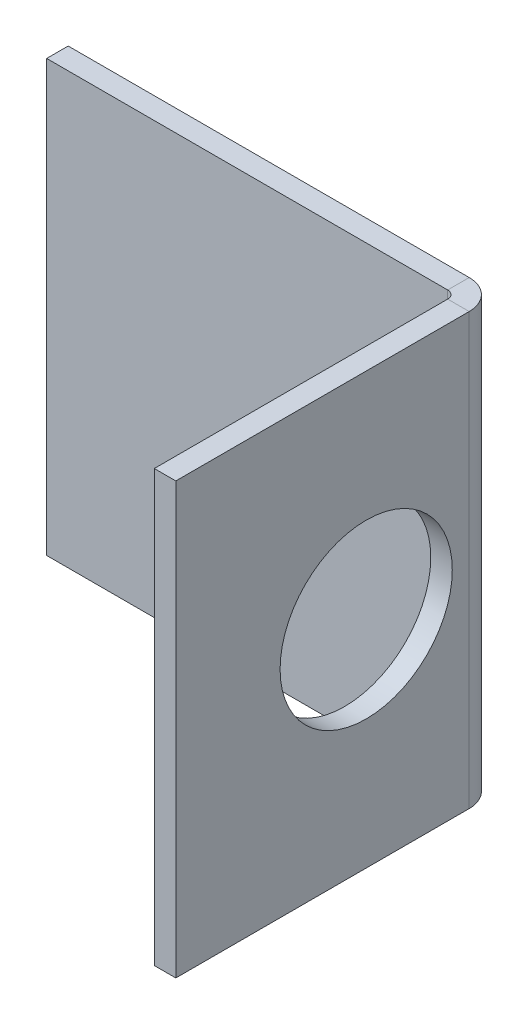
ISO-10303-21;
HEADER;
FILE_DESCRIPTION(('STEP AP214'),'2;1');
FILE_NAME('part.step','',(''),(''),'','','');
FILE_SCHEMA(('AUTOMOTIVE_DESIGN { 1 0 10303 214 1 1 1 1 }'));
ENDSEC;
DATA;
#1=APPLICATION_CONTEXT('core data for automotive mechanical design processes');
#2=APPLICATION_PROTOCOL_DEFINITION('international standard','automotive_design',2000,#1);
#3=PRODUCT_CONTEXT('',#1,'mechanical');
#4=PRODUCT('Part','Part','',(#3));
#5=PRODUCT_RELATED_PRODUCT_CATEGORY('part','',(#4));
#6=PRODUCT_DEFINITION_FORMATION('','',#4);
#7=PRODUCT_DEFINITION_CONTEXT('part definition',#1,'design');
#8=PRODUCT_DEFINITION('design','',#6,#7);
#9=PRODUCT_DEFINITION_SHAPE('','',#8);
#10=(LENGTH_UNIT() NAMED_UNIT(*) SI_UNIT(.MILLI.,.METRE.));
#11=(NAMED_UNIT(*) PLANE_ANGLE_UNIT() SI_UNIT($,.RADIAN.));
#12=(NAMED_UNIT(*) SI_UNIT($,.STERADIAN.) SOLID_ANGLE_UNIT());
#13=UNCERTAINTY_MEASURE_WITH_UNIT(LENGTH_MEASURE(1.E-05),#10,'distance_accuracy_value','');
#14=(GEOMETRIC_REPRESENTATION_CONTEXT(3) GLOBAL_UNCERTAINTY_ASSIGNED_CONTEXT((#13)) GLOBAL_UNIT_ASSIGNED_CONTEXT((#10,
#11,#12)) REPRESENTATION_CONTEXT('',''));
#15=CARTESIAN_POINT('',(0.,0.,0.));
#16=DIRECTION('',(0.,0.,1.));
#17=DIRECTION('',(1.,0.,0.));
#18=AXIS2_PLACEMENT_3D('',#15,#16,#17);
#19=CARTESIAN_POINT('',(-20.,20.,2.));
#20=DIRECTION('',(0.,-1.,0.));
#21=DIRECTION('',(0.,0.,-1.));
#22=AXIS2_PLACEMENT_3D('',#19,#20,#21);
#23=PLANE('',#22);
#24=DIRECTION('',(0.,0.,-1.));
#25=VECTOR('',#24,1.);
#26=CARTESIAN_POINT('',(17.2634,20.,2.));
#27=LINE('',#26,#25);
#28=CARTESIAN_POINT('',(17.2634,20.,2.));
#29=VERTEX_POINT('',#28);
#30=CARTESIAN_POINT('',(17.2634,20.,0.));
#31=VERTEX_POINT('',#30);
#32=EDGE_CURVE('E120',#29,#31,#27,.T.);
#33=ORIENTED_EDGE('',*,*,#32,.T.);
#34=DIRECTION('',(-1.,0.,0.));
#35=VECTOR('',#34,1.);
#36=CARTESIAN_POINT('',(-20.,20.,0.));
#37=LINE('',#36,#35);
#38=CARTESIAN_POINT('',(-20.,20.,0.));
#39=VERTEX_POINT('',#38);
#40=EDGE_CURVE('E102',#31,#39,#37,.T.);
#41=ORIENTED_EDGE('',*,*,#40,.T.);
#42=DIRECTION('',(0.,0.,-1.));
#43=VECTOR('',#42,1.);
#44=CARTESIAN_POINT('',(-20.,20.,2.));
#45=LINE('',#44,#43);
#46=CARTESIAN_POINT('',(-20.,20.,2.));
#47=VERTEX_POINT('',#46);
#48=EDGE_CURVE('E13',#47,#39,#45,.T.);
#49=ORIENTED_EDGE('',*,*,#48,.F.);
#50=DIRECTION('',(-1.,0.,0.));
#51=VECTOR('',#50,1.);
#52=CARTESIAN_POINT('',(-20.,20.,2.));
#53=LINE('',#52,#51);
#54=EDGE_CURVE('E112',#29,#47,#53,.T.);
#55=ORIENTED_EDGE('',*,*,#54,.F.);
#56=EDGE_LOOP('',(#33,#41,#49,#55));
#57=FACE_BOUND('',#56,.T.);
#58=ADVANCED_FACE('F58',(#57),#23,.F.);
#59=CARTESIAN_POINT('',(-20.,-20.,2.));
#60=DIRECTION('',(0.,1.,0.));
#61=DIRECTION('',(0.,0.,1.));
#62=AXIS2_PLACEMENT_3D('',#59,#60,#61);
#63=PLANE('',#62);
#64=DIRECTION('',(0.,0.,-1.));
#65=VECTOR('',#64,1.);
#66=CARTESIAN_POINT('',(17.2634,-20.,2.));
#67=LINE('',#66,#65);
#68=CARTESIAN_POINT('',(17.2634,-20.,2.));
#69=VERTEX_POINT('',#68);
#70=CARTESIAN_POINT('',(17.2634,-20.,0.));
#71=VERTEX_POINT('',#70);
#72=EDGE_CURVE('E117',#69,#71,#67,.T.);
#73=ORIENTED_EDGE('',*,*,#72,.F.);
#74=DIRECTION('',(1.,0.,0.));
#75=VECTOR('',#74,1.);
#76=CARTESIAN_POINT('',(-20.,-20.,2.));
#77=LINE('',#76,#75);
#78=CARTESIAN_POINT('',(-20.,-20.,2.));
#79=VERTEX_POINT('',#78);
#80=EDGE_CURVE('E108',#79,#69,#77,.T.);
#81=ORIENTED_EDGE('',*,*,#80,.F.);
#82=DIRECTION('',(0.,0.,-1.));
#83=VECTOR('',#82,1.);
#84=CARTESIAN_POINT('',(-20.,-20.,2.));
#85=LINE('',#84,#83);
#86=CARTESIAN_POINT('',(-20.,-20.,0.));
#87=VERTEX_POINT('',#86);
#88=EDGE_CURVE('E65',#79,#87,#85,.T.);
#89=ORIENTED_EDGE('',*,*,#88,.T.);
#90=DIRECTION('',(1.,0.,0.));
#91=VECTOR('',#90,1.);
#92=CARTESIAN_POINT('',(-20.,-20.,0.));
#93=LINE('',#92,#91);
#94=EDGE_CURVE('E101',#87,#71,#93,.T.);
#95=ORIENTED_EDGE('',*,*,#94,.T.);
#96=EDGE_LOOP('',(#73,#81,#89,#95));
#97=FACE_BOUND('',#96,.T.);
#98=ADVANCED_FACE('F107',(#97),#63,.F.);
#99=CARTESIAN_POINT('',(0.,0.,2.));
#100=DIRECTION('',(0.,0.,-1.));
#101=DIRECTION('',(-1.,0.,0.));
#102=AXIS2_PLACEMENT_3D('',#99,#100,#101);
#103=PLANE('',#102);
#104=DIRECTION('',(0.,1.,0.));
#105=VECTOR('',#104,1.);
#106=CARTESIAN_POINT('',(17.2634,20.,2.));
#107=LINE('',#106,#105);
#108=EDGE_CURVE('E127',#29,#69,#107,.F.);
#109=ORIENTED_EDGE('',*,*,#108,.F.);
#110=ORIENTED_EDGE('',*,*,#54,.T.);
#111=DIRECTION('',(0.,-1.,0.));
#112=VECTOR('',#111,1.);
#113=CARTESIAN_POINT('',(-20.,-20.,2.));
#114=LINE('',#113,#112);
#115=EDGE_CURVE('E81',#47,#79,#114,.T.);
#116=ORIENTED_EDGE('',*,*,#115,.T.);
#117=ORIENTED_EDGE('',*,*,#80,.T.);
#118=EDGE_LOOP('',(#109,#110,#116,#117));
#119=FACE_BOUND('',#118,.T.);
#120=ADVANCED_FACE('F236',(#119),#103,.F.);
#121=CARTESIAN_POINT('',(0.,0.,0.));
#122=DIRECTION('',(0.,0.,-1.));
#123=DIRECTION('',(-1.,0.,0.));
#124=AXIS2_PLACEMENT_3D('',#121,#122,#123);
#125=PLANE('',#124);
#126=ORIENTED_EDGE('',*,*,#40,.F.);
#127=DIRECTION('',(0.,1.,0.));
#128=VECTOR('',#127,1.);
#129=CARTESIAN_POINT('',(17.2634,20.,0.));
#130=LINE('',#129,#128);
#131=EDGE_CURVE('E111',#31,#71,#130,.F.);
#132=ORIENTED_EDGE('',*,*,#131,.T.);
#133=ORIENTED_EDGE('',*,*,#94,.F.);
#134=DIRECTION('',(0.,-1.,0.));
#135=VECTOR('',#134,1.);
#136=CARTESIAN_POINT('',(-20.,-20.,0.));
#137=LINE('',#136,#135);
#138=EDGE_CURVE('E93',#39,#87,#137,.T.);
#139=ORIENTED_EDGE('',*,*,#138,.F.);
#140=EDGE_LOOP('',(#126,#132,#133,#139));
#141=FACE_BOUND('',#140,.T.);
#142=ADVANCED_FACE('F110',(#141),#125,.T.);
#143=CARTESIAN_POINT('',(-20.,-20.,2.));
#144=DIRECTION('',(1.,0.,0.));
#145=DIRECTION('',(0.,0.,-1.));
#146=AXIS2_PLACEMENT_3D('',#143,#144,#145);
#147=PLANE('',#146);
#148=ORIENTED_EDGE('',*,*,#138,.T.);
#149=ORIENTED_EDGE('',*,*,#88,.F.);
#150=ORIENTED_EDGE('',*,*,#115,.F.);
#151=ORIENTED_EDGE('',*,*,#48,.T.);
#152=EDGE_LOOP('',(#148,#149,#150,#151));
#153=FACE_BOUND('',#152,.T.);
#154=ADVANCED_FACE('F95',(#153),#147,.F.);
#155=CARTESIAN_POINT('',(17.2634,-20.,2.7366));
#156=DIRECTION('',(0.,-1.,0.));
#157=DIRECTION('',(0.,0.,-1.));
#158=AXIS2_PLACEMENT_3D('',#155,#156,#157);
#159=PLANE('',#158);
#160=DIRECTION('',(-1.,0.,0.));
#161=VECTOR('',#160,1.);
#162=CARTESIAN_POINT('',(20.,-20.,2.73659999999999));
#163=LINE('',#162,#161);
#164=CARTESIAN_POINT('',(18.,-20.,2.7366));
#165=VERTEX_POINT('',#164);
#166=CARTESIAN_POINT('',(20.,-20.,2.73659999999999));
#167=VERTEX_POINT('',#166);
#168=EDGE_CURVE('E139',#165,#167,#163,.F.);
#169=ORIENTED_EDGE('',*,*,#168,.F.);
#170=CARTESIAN_POINT('',(17.2634,-20.,2.7366));
#171=DIRECTION('',(0.,1.,0.));
#172=DIRECTION('',(0.,0.,1.));
#173=AXIS2_PLACEMENT_3D('',#170,#171,#172);
#174=CIRCLE('',#173,0.7366);
#175=EDGE_CURVE('E131',#69,#165,#174,.F.);
#176=ORIENTED_EDGE('',*,*,#175,.F.);
#177=ORIENTED_EDGE('',*,*,#72,.T.);
#178=CARTESIAN_POINT('',(17.2634,-20.,2.7366));
#179=DIRECTION('',(0.,1.,0.));
#180=DIRECTION('',(0.,0.,1.));
#181=AXIS2_PLACEMENT_3D('',#178,#179,#180);
#182=CIRCLE('',#181,2.7366);
#183=EDGE_CURVE('E72',#71,#167,#182,.F.);
#184=ORIENTED_EDGE('',*,*,#183,.T.);
#185=EDGE_LOOP('',(#169,#176,#177,#184));
#186=FACE_BOUND('',#185,.T.);
#187=ADVANCED_FACE('F248',(#186),#159,.T.);
#188=CARTESIAN_POINT('',(17.2634,20.,2.7366));
#189=DIRECTION('',(0.,-1.,0.));
#190=DIRECTION('',(0.,0.,-1.));
#191=AXIS2_PLACEMENT_3D('',#188,#189,#190);
#192=PLANE('',#191);
#193=CARTESIAN_POINT('',(17.2634,20.,2.7366));
#194=DIRECTION('',(0.,1.,0.));
#195=DIRECTION('',(0.,0.,1.));
#196=AXIS2_PLACEMENT_3D('',#193,#194,#195);
#197=CIRCLE('',#196,0.7366);
#198=CARTESIAN_POINT('',(18.,20.,2.7366));
#199=VERTEX_POINT('',#198);
#200=EDGE_CURVE('E124',#199,#29,#197,.T.);
#201=ORIENTED_EDGE('',*,*,#200,.F.);
#202=DIRECTION('',(-1.,0.,0.));
#203=VECTOR('',#202,1.);
#204=CARTESIAN_POINT('',(18.,20.,2.7366));
#205=LINE('',#204,#203);
#206=CARTESIAN_POINT('',(20.,20.,2.73659999999999));
#207=VERTEX_POINT('',#206);
#208=EDGE_CURVE('E146',#199,#207,#205,.F.);
#209=ORIENTED_EDGE('',*,*,#208,.T.);
#210=CARTESIAN_POINT('',(17.2634,20.,2.7366));
#211=DIRECTION('',(0.,1.,0.));
#212=DIRECTION('',(0.,0.,1.));
#213=AXIS2_PLACEMENT_3D('',#210,#211,#212);
#214=CIRCLE('',#213,2.7366);
#215=EDGE_CURVE('E134',#207,#31,#214,.T.);
#216=ORIENTED_EDGE('',*,*,#215,.T.);
#217=ORIENTED_EDGE('',*,*,#32,.F.);
#218=EDGE_LOOP('',(#201,#209,#216,#217));
#219=FACE_BOUND('',#218,.T.);
#220=ADVANCED_FACE('F229',(#219),#192,.F.);
#221=CARTESIAN_POINT('',(17.2634,20.,2.7366));
#222=DIRECTION('',(0.,1.,0.));
#223=DIRECTION('',(1.,0.,0.));
#224=AXIS2_PLACEMENT_3D('',#221,#222,#223);
#225=CYLINDRICAL_SURFACE('',#224,2.7366);
#226=ORIENTED_EDGE('',*,*,#131,.F.);
#227=ORIENTED_EDGE('',*,*,#215,.F.);
#228=DIRECTION('',(0.,1.,0.));
#229=VECTOR('',#228,1.);
#230=CARTESIAN_POINT('',(20.,-20.,2.73659999999999));
#231=LINE('',#230,#229);
#232=EDGE_CURVE('E149',#207,#167,#231,.F.);
#233=ORIENTED_EDGE('',*,*,#232,.T.);
#234=ORIENTED_EDGE('',*,*,#183,.F.);
#235=EDGE_LOOP('',(#226,#227,#233,#234));
#236=FACE_BOUND('',#235,.T.);
#237=ADVANCED_FACE('F303',(#236),#225,.T.);
#238=CARTESIAN_POINT('',(17.2634,20.,2.7366));
#239=DIRECTION('',(0.,1.,0.));
#240=DIRECTION('',(1.,0.,0.));
#241=AXIS2_PLACEMENT_3D('',#238,#239,#240);
#242=CYLINDRICAL_SURFACE('',#241,0.7366);
#243=ORIENTED_EDGE('',*,*,#108,.T.);
#244=ORIENTED_EDGE('',*,*,#175,.T.);
#245=DIRECTION('',(0.,1.,0.));
#246=VECTOR('',#245,1.);
#247=CARTESIAN_POINT('',(18.,-20.,2.7366));
#248=LINE('',#247,#246);
#249=EDGE_CURVE('E142',#165,#199,#248,.T.);
#250=ORIENTED_EDGE('',*,*,#249,.T.);
#251=ORIENTED_EDGE('',*,*,#200,.T.);
#252=EDGE_LOOP('',(#243,#244,#250,#251));
#253=FACE_BOUND('',#252,.T.);
#254=ADVANCED_FACE('F234',(#253),#242,.F.);
#255=CARTESIAN_POINT('',(20.,-20.,1.99999999999999));
#256=DIRECTION('',(0.,1.,0.));
#257=DIRECTION('',(0.,0.,1.));
#258=AXIS2_PLACEMENT_3D('',#255,#256,#257);
#259=PLANE('',#258);
#260=ORIENTED_EDGE('',*,*,#168,.T.);
#261=DIRECTION('',(0.,0.,-1.));
#262=VECTOR('',#261,1.);
#263=CARTESIAN_POINT('',(20.,-20.,0.));
#264=LINE('',#263,#262);
#265=CARTESIAN_POINT('',(20.0000000000001,-20.,30.));
#266=VERTEX_POINT('',#265);
#267=EDGE_CURVE('E160',#266,#167,#264,.T.);
#268=ORIENTED_EDGE('',*,*,#267,.F.);
#269=DIRECTION('',(-1.,0.,0.));
#270=VECTOR('',#269,1.);
#271=CARTESIAN_POINT('',(20.0000000000001,-20.,30.));
#272=LINE('',#271,#270);
#273=CARTESIAN_POINT('',(18.0000000000001,-20.,30.));
#274=VERTEX_POINT('',#273);
#275=EDGE_CURVE('E169',#266,#274,#272,.T.);
#276=ORIENTED_EDGE('',*,*,#275,.T.);
#277=DIRECTION('',(0.,0.,1.));
#278=VECTOR('',#277,1.);
#279=CARTESIAN_POINT('',(18.,-20.,2.));
#280=LINE('',#279,#278);
#281=EDGE_CURVE('E151',#274,#165,#280,.F.);
#282=ORIENTED_EDGE('',*,*,#281,.T.);
#283=EDGE_LOOP('',(#260,#268,#276,#282));
#284=FACE_BOUND('',#283,.T.);
#285=ADVANCED_FACE('F322',(#284),#259,.F.);
#286=CARTESIAN_POINT('',(20.0000000000001,20.,30.));
#287=DIRECTION('',(0.,-1.,0.));
#288=DIRECTION('',(0.,0.,-1.));
#289=AXIS2_PLACEMENT_3D('',#286,#287,#288);
#290=PLANE('',#289);
#291=ORIENTED_EDGE('',*,*,#208,.F.);
#292=DIRECTION('',(0.,0.,-1.));
#293=VECTOR('',#292,1.);
#294=CARTESIAN_POINT('',(18.0000000000001,20.,30.));
#295=LINE('',#294,#293);
#296=CARTESIAN_POINT('',(18.0000000000001,20.,30.));
#297=VERTEX_POINT('',#296);
#298=EDGE_CURVE('E154',#199,#297,#295,.F.);
#299=ORIENTED_EDGE('',*,*,#298,.T.);
#300=DIRECTION('',(-1.,0.,0.));
#301=VECTOR('',#300,1.);
#302=CARTESIAN_POINT('',(20.0000000000001,20.,30.));
#303=LINE('',#302,#301);
#304=CARTESIAN_POINT('',(20.0000000000001,20.,30.));
#305=VERTEX_POINT('',#304);
#306=EDGE_CURVE('E128',#305,#297,#303,.T.);
#307=ORIENTED_EDGE('',*,*,#306,.F.);
#308=DIRECTION('',(0.,0.,1.));
#309=VECTOR('',#308,1.);
#310=CARTESIAN_POINT('',(20.,20.,0.));
#311=LINE('',#310,#309);
#312=EDGE_CURVE('E163',#207,#305,#311,.T.);
#313=ORIENTED_EDGE('',*,*,#312,.F.);
#314=EDGE_LOOP('',(#291,#299,#307,#313));
#315=FACE_BOUND('',#314,.T.);
#316=ADVANCED_FACE('F200',(#315),#290,.F.);
#317=CARTESIAN_POINT('',(20.,0.,0.));
#318=DIRECTION('',(-1.,0.,0.));
#319=DIRECTION('',(0.,0.,1.));
#320=AXIS2_PLACEMENT_3D('',#317,#318,#319);
#321=PLANE('',#320);
#322=CARTESIAN_POINT('',(20.,0.,12.3099999999999));
#323=DIRECTION('',(-1.,0.,0.));
#324=DIRECTION('',(0.,0.,1.));
#325=AXIS2_PLACEMENT_3D('',#322,#323,#324);
#326=CIRCLE('',#325,8.);
#327=CARTESIAN_POINT('',(20.0000000000001,0.,20.3099999999999));
#328=VERTEX_POINT('',#327);
#329=EDGE_CURVE('E143',#328,#328,#326,.F.);
#330=ORIENTED_EDGE('',*,*,#329,.F.);
#331=EDGE_LOOP('',(#330));
#332=FACE_BOUND('',#331,.T.);
#333=ORIENTED_EDGE('',*,*,#232,.F.);
#334=ORIENTED_EDGE('',*,*,#312,.T.);
#335=DIRECTION('',(0.,-1.,0.));
#336=VECTOR('',#335,1.);
#337=CARTESIAN_POINT('',(20.0000000000001,0.,30.));
#338=LINE('',#337,#336);
#339=EDGE_CURVE('E166',#305,#266,#338,.T.);
#340=ORIENTED_EDGE('',*,*,#339,.T.);
#341=ORIENTED_EDGE('',*,*,#267,.T.);
#342=EDGE_LOOP('',(#333,#334,#340,#341));
#343=FACE_BOUND('',#342,.T.);
#344=ADVANCED_FACE('F187',(#332,#343),#321,.F.);
#345=CARTESIAN_POINT('',(18.,0.,0.));
#346=DIRECTION('',(-1.,0.,0.));
#347=DIRECTION('',(0.,0.,1.));
#348=AXIS2_PLACEMENT_3D('',#345,#346,#347);
#349=PLANE('',#348);
#350=CARTESIAN_POINT('',(18.,0.,12.3099999999999));
#351=DIRECTION('',(-1.,0.,0.));
#352=DIRECTION('',(0.,0.,1.));
#353=AXIS2_PLACEMENT_3D('',#350,#351,#352);
#354=CIRCLE('',#353,8.);
#355=CARTESIAN_POINT('',(18.,0.,20.3099999999999));
#356=VERTEX_POINT('',#355);
#357=EDGE_CURVE('E176',#356,#356,#354,.T.);
#358=ORIENTED_EDGE('',*,*,#357,.F.);
#359=EDGE_LOOP('',(#358));
#360=FACE_BOUND('',#359,.T.);
#361=ORIENTED_EDGE('',*,*,#298,.F.);
#362=ORIENTED_EDGE('',*,*,#249,.F.);
#363=ORIENTED_EDGE('',*,*,#281,.F.);
#364=DIRECTION('',(0.,1.,0.));
#365=VECTOR('',#364,1.);
#366=CARTESIAN_POINT('',(18.0000000000001,-20.,30.));
#367=LINE('',#366,#365);
#368=EDGE_CURVE('E157',#297,#274,#367,.F.);
#369=ORIENTED_EDGE('',*,*,#368,.F.);
#370=EDGE_LOOP('',(#361,#362,#363,#369));
#371=FACE_BOUND('',#370,.T.);
#372=ADVANCED_FACE('F183',(#360,#371),#349,.T.);
#373=CARTESIAN_POINT('',(20.0000000000001,-20.,30.));
#374=DIRECTION('',(0.,0.,-1.));
#375=DIRECTION('',(-1.,0.,0.));
#376=AXIS2_PLACEMENT_3D('',#373,#374,#375);
#377=PLANE('',#376);
#378=ORIENTED_EDGE('',*,*,#368,.T.);
#379=ORIENTED_EDGE('',*,*,#275,.F.);
#380=ORIENTED_EDGE('',*,*,#339,.F.);
#381=ORIENTED_EDGE('',*,*,#306,.T.);
#382=EDGE_LOOP('',(#378,#379,#380,#381));
#383=FACE_BOUND('',#382,.T.);
#384=ADVANCED_FACE('F186',(#383),#377,.F.);
#385=CARTESIAN_POINT('',(20.0010000000001,0.,12.3099999999999));
#386=DIRECTION('',(-1.,0.,0.));
#387=DIRECTION('',(0.,0.,1.));
#388=AXIS2_PLACEMENT_3D('',#385,#386,#387);
#389=CYLINDRICAL_SURFACE('',#388,8.);
#390=ORIENTED_EDGE('',*,*,#357,.T.);
#391=EDGE_LOOP('',(#390));
#392=FACE_BOUND('',#391,.T.);
#393=ORIENTED_EDGE('',*,*,#329,.T.);
#394=EDGE_LOOP('',(#393));
#395=FACE_BOUND('',#394,.T.);
#396=ADVANCED_FACE('F180',(#392,#395),#389,.F.);
#397=CLOSED_SHELL('',(#58,#98,#120,#142,#154,#187,#220,#237,#254,#285,#316,#344,#372,#384,#396));
#398=MANIFOLD_SOLID_BREP('B2',#397);
#399=ADVANCED_BREP_SHAPE_REPRESENTATION('',(#18,#398),#14);
#400=SHAPE_DEFINITION_REPRESENTATION(#9,#399);
ENDSEC;
END-ISO-10303-21;
